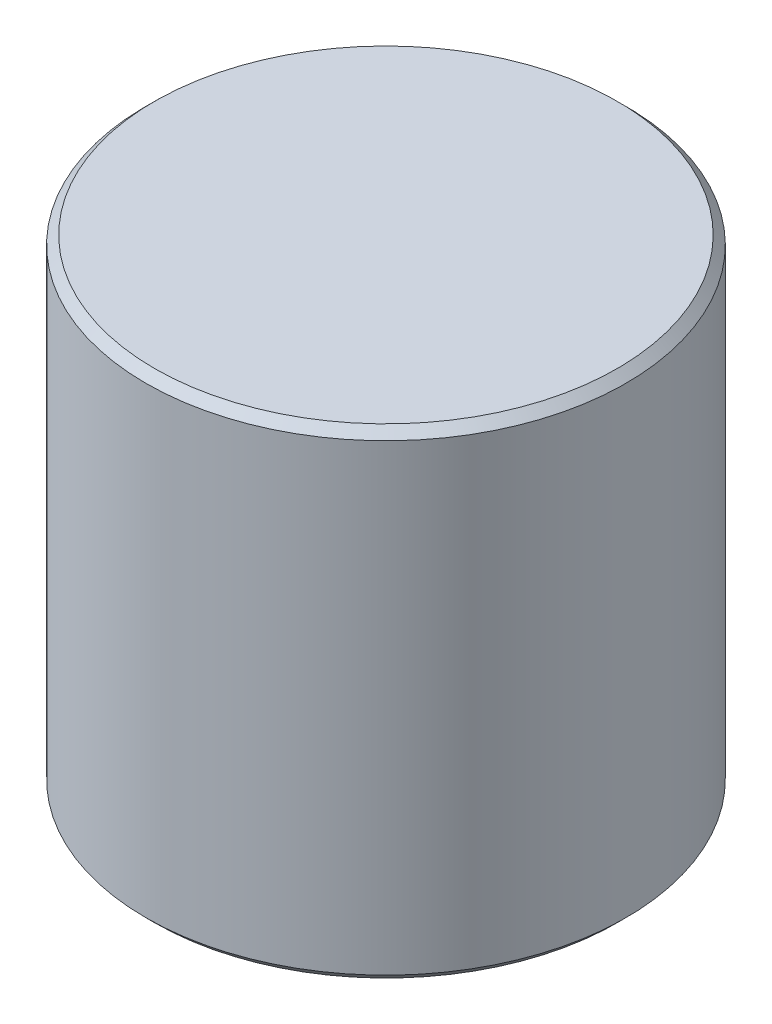
ISO-10303-21;
HEADER;
FILE_DESCRIPTION(('STEP AP214'),'2;1');
FILE_NAME('part.step','',(''),(''),'','','');
FILE_SCHEMA(('AUTOMOTIVE_DESIGN { 1 0 10303 214 1 1 1 1 }'));
ENDSEC;
DATA;
#1=APPLICATION_CONTEXT('core data for automotive mechanical design processes');
#2=APPLICATION_PROTOCOL_DEFINITION('international standard','automotive_design',2000,#1);
#3=PRODUCT_CONTEXT('',#1,'mechanical');
#4=PRODUCT('Part','Part','',(#3));
#5=PRODUCT_RELATED_PRODUCT_CATEGORY('part','',(#4));
#6=PRODUCT_DEFINITION_FORMATION('','',#4);
#7=PRODUCT_DEFINITION_CONTEXT('part definition',#1,'design');
#8=PRODUCT_DEFINITION('design','',#6,#7);
#9=PRODUCT_DEFINITION_SHAPE('','',#8);
#10=(LENGTH_UNIT() NAMED_UNIT(*) SI_UNIT(.MILLI.,.METRE.));
#11=(NAMED_UNIT(*) PLANE_ANGLE_UNIT() SI_UNIT($,.RADIAN.));
#12=(NAMED_UNIT(*) SI_UNIT($,.STERADIAN.) SOLID_ANGLE_UNIT());
#13=UNCERTAINTY_MEASURE_WITH_UNIT(LENGTH_MEASURE(1.E-05),#10,'distance_accuracy_value','');
#14=(GEOMETRIC_REPRESENTATION_CONTEXT(3) GLOBAL_UNCERTAINTY_ASSIGNED_CONTEXT((#13)) GLOBAL_UNIT_ASSIGNED_CONTEXT((#10,
#11,#12)) REPRESENTATION_CONTEXT('',''));
#15=CARTESIAN_POINT('',(0.,0.,0.));
#16=DIRECTION('',(0.,0.,1.));
#17=DIRECTION('',(1.,0.,0.));
#18=AXIS2_PLACEMENT_3D('',#15,#16,#17);
#19=CARTESIAN_POINT('',(0.,35.56,0.));
#20=DIRECTION('',(0.,-1.,0.));
#21=DIRECTION('',(0.,0.,-1.));
#22=AXIS2_PLACEMENT_3D('',#19,#20,#21);
#23=CYLINDRICAL_SURFACE('',#22,17.78);
#24=CARTESIAN_POINT('',(0.,34.925,0.));
#25=DIRECTION('',(0.,1.,0.));
#26=DIRECTION('',(0.,0.,1.));
#27=AXIS2_PLACEMENT_3D('',#24,#25,#26);
#28=CIRCLE('',#27,17.78);
#29=CARTESIAN_POINT('',(0.,34.925,17.78));
#30=VERTEX_POINT('',#29);
#31=EDGE_CURVE('E47',#30,#30,#28,.F.);
#32=ORIENTED_EDGE('',*,*,#31,.T.);
#33=EDGE_LOOP('',(#32));
#34=FACE_BOUND('',#33,.T.);
#35=CARTESIAN_POINT('',(0.,0.634999999999969,0.));
#36=DIRECTION('',(0.,1.,0.));
#37=DIRECTION('',(0.,0.,1.));
#38=AXIS2_PLACEMENT_3D('',#35,#36,#37);
#39=CIRCLE('',#38,17.78);
#40=CARTESIAN_POINT('',(0.,0.634999999999969,17.78));
#41=VERTEX_POINT('',#40);
#42=EDGE_CURVE('E51',#41,#41,#39,.T.);
#43=ORIENTED_EDGE('',*,*,#42,.T.);
#44=EDGE_LOOP('',(#43));
#45=FACE_BOUND('',#44,.T.);
#46=ADVANCED_FACE('F39',(#34,#45),#23,.T.);
#47=CARTESIAN_POINT('',(0.,35.56,0.));
#48=DIRECTION('',(0.,1.,0.));
#49=DIRECTION('',(0.,0.,1.));
#50=AXIS2_PLACEMENT_3D('',#47,#48,#49);
#51=PLANE('',#50);
#52=CARTESIAN_POINT('',(0.,35.56,0.));
#53=DIRECTION('',(0.,1.,0.));
#54=DIRECTION('',(0.,0.,1.));
#55=AXIS2_PLACEMENT_3D('',#52,#53,#54);
#56=CIRCLE('',#55,17.145);
#57=CARTESIAN_POINT('',(0.,35.56,17.145));
#58=VERTEX_POINT('',#57);
#59=EDGE_CURVE('E10',#58,#58,#56,.T.);
#60=ORIENTED_EDGE('',*,*,#59,.T.);
#61=EDGE_LOOP('',(#60));
#62=FACE_BOUND('',#61,.T.);
#63=ADVANCED_FACE('F77',(#62),#51,.T.);
#64=CARTESIAN_POINT('',(0.,0.,0.));
#65=DIRECTION('',(0.,1.,0.));
#66=DIRECTION('',(0.,0.,1.));
#67=AXIS2_PLACEMENT_3D('',#64,#65,#66);
#68=PLANE('',#67);
#69=CARTESIAN_POINT('',(0.,0.,0.));
#70=DIRECTION('',(0.,1.,0.));
#71=DIRECTION('',(0.,0.,1.));
#72=AXIS2_PLACEMENT_3D('',#69,#70,#71);
#73=CIRCLE('',#72,17.145);
#74=CARTESIAN_POINT('',(0.,0.,17.145));
#75=VERTEX_POINT('',#74);
#76=EDGE_CURVE('E55',#75,#75,#73,.F.);
#77=ORIENTED_EDGE('',*,*,#76,.T.);
#78=EDGE_LOOP('',(#77));
#79=FACE_BOUND('',#78,.T.);
#80=CARTESIAN_POINT('',(0.,0.,0.));
#81=DIRECTION('',(0.,-1.,0.));
#82=DIRECTION('',(0.,0.,1.));
#83=AXIS2_PLACEMENT_3D('',#80,#81,#82);
#84=CIRCLE('',#83,10.5);
#85=CARTESIAN_POINT('',(0.,0.,10.5));
#86=VERTEX_POINT('',#85);
#87=EDGE_CURVE('E61',#86,#86,#84,.T.);
#88=ORIENTED_EDGE('',*,*,#87,.F.);
#89=EDGE_LOOP('',(#88));
#90=FACE_BOUND('',#89,.T.);
#91=ADVANCED_FACE('F72',(#79,#90),#68,.F.);
#92=CARTESIAN_POINT('',(0.,1.,0.));
#93=DIRECTION('',(0.,-1.,0.));
#94=DIRECTION('',(0.,0.,-1.));
#95=AXIS2_PLACEMENT_3D('',#92,#93,#94);
#96=CYLINDRICAL_SURFACE('',#95,10.5);
#97=CARTESIAN_POINT('',(0.,1.,0.));
#98=DIRECTION('',(0.,-1.,0.));
#99=DIRECTION('',(0.,0.,1.));
#100=AXIS2_PLACEMENT_3D('',#97,#98,#99);
#101=CIRCLE('',#100,10.5);
#102=CARTESIAN_POINT('',(0.,1.,10.5));
#103=VERTEX_POINT('',#102);
#104=EDGE_CURVE('E60',#103,#103,#101,.T.);
#105=ORIENTED_EDGE('',*,*,#104,.F.);
#106=EDGE_LOOP('',(#105));
#107=FACE_BOUND('',#106,.T.);
#108=ORIENTED_EDGE('',*,*,#87,.T.);
#109=EDGE_LOOP('',(#108));
#110=FACE_BOUND('',#109,.T.);
#111=ADVANCED_FACE('F69',(#107,#110),#96,.F.);
#112=CARTESIAN_POINT('',(0.,1.,0.));
#113=DIRECTION('',(0.,1.,0.));
#114=DIRECTION('',(0.,0.,1.));
#115=AXIS2_PLACEMENT_3D('',#112,#113,#114);
#116=PLANE('',#115);
#117=ORIENTED_EDGE('',*,*,#104,.T.);
#118=EDGE_LOOP('',(#117));
#119=FACE_BOUND('',#118,.T.);
#120=ADVANCED_FACE('F67',(#119),#116,.F.);
#121=CARTESIAN_POINT('',(0.,0.,0.));
#122=DIRECTION('',(0.,1.,0.));
#123=DIRECTION('',(0.,0.,1.));
#124=AXIS2_PLACEMENT_3D('',#121,#122,#123);
#125=CONICAL_SURFACE('',#124,17.145,0.785398163397448);
#126=ORIENTED_EDGE('',*,*,#42,.F.);
#127=EDGE_LOOP('',(#126));
#128=FACE_BOUND('',#127,.T.);
#129=ORIENTED_EDGE('',*,*,#76,.F.);
#130=EDGE_LOOP('',(#129));
#131=FACE_BOUND('',#130,.T.);
#132=ADVANCED_FACE('F90',(#128,#131),#125,.T.);
#133=CARTESIAN_POINT('',(0.,34.925,0.));
#134=DIRECTION('',(0.,-1.,0.));
#135=DIRECTION('',(0.,0.,-1.));
#136=AXIS2_PLACEMENT_3D('',#133,#134,#135);
#137=CONICAL_SURFACE('',#136,17.78,0.785398163397446);
#138=ORIENTED_EDGE('',*,*,#59,.F.);
#139=EDGE_LOOP('',(#138));
#140=FACE_BOUND('',#139,.T.);
#141=ORIENTED_EDGE('',*,*,#31,.F.);
#142=EDGE_LOOP('',(#141));
#143=FACE_BOUND('',#142,.T.);
#144=ADVANCED_FACE('F42',(#140,#143),#137,.T.);
#145=CLOSED_SHELL('',(#46,#63,#91,#111,#120,#132,#144));
#146=MANIFOLD_SOLID_BREP('B2',#145);
#147=ADVANCED_BREP_SHAPE_REPRESENTATION('',(#18,#146),#14);
#148=SHAPE_DEFINITION_REPRESENTATION(#9,#147);
ENDSEC;
END-ISO-10303-21;
